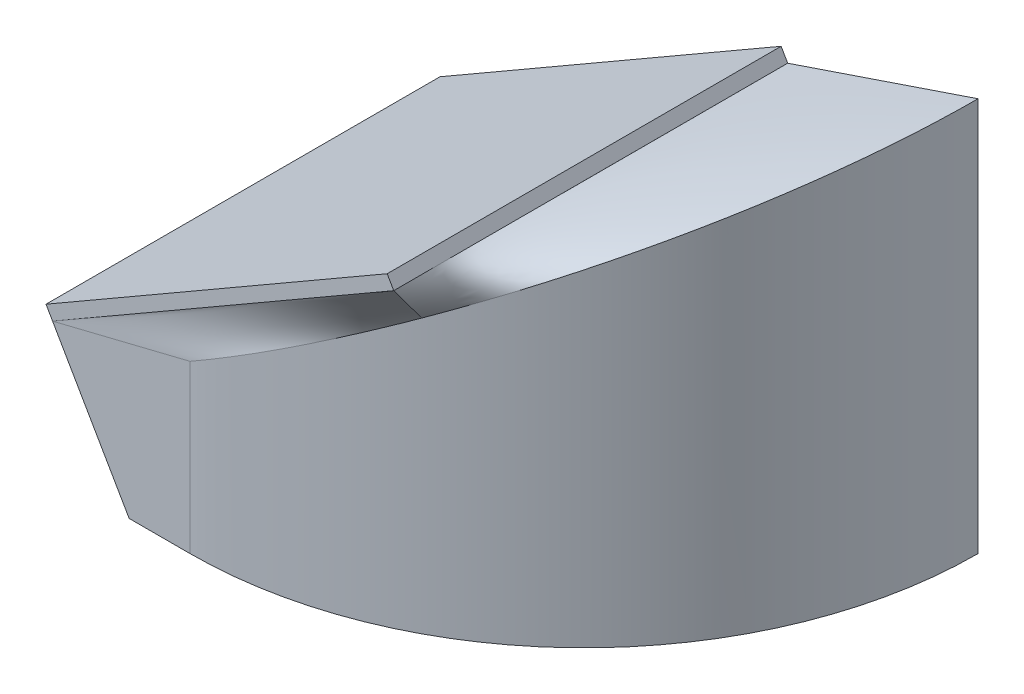
ISO-10303-21;
HEADER;
FILE_DESCRIPTION(('STEP AP214'),'2;1');
FILE_NAME('part.step','',(''),(''),'','','');
FILE_SCHEMA(('AUTOMOTIVE_DESIGN { 1 0 10303 214 1 1 1 1 }'));
ENDSEC;
DATA;
#1=APPLICATION_CONTEXT('core data for automotive mechanical design processes');
#2=APPLICATION_PROTOCOL_DEFINITION('international standard','automotive_design',2000,#1);
#3=PRODUCT_CONTEXT('',#1,'mechanical');
#4=PRODUCT('Part','Part','',(#3));
#5=PRODUCT_RELATED_PRODUCT_CATEGORY('part','',(#4));
#6=PRODUCT_DEFINITION_FORMATION('','',#4);
#7=PRODUCT_DEFINITION_CONTEXT('part definition',#1,'design');
#8=PRODUCT_DEFINITION('design','',#6,#7);
#9=PRODUCT_DEFINITION_SHAPE('','',#8);
#10=(LENGTH_UNIT() NAMED_UNIT(*) SI_UNIT(.MILLI.,.METRE.));
#11=(NAMED_UNIT(*) PLANE_ANGLE_UNIT() SI_UNIT($,.RADIAN.));
#12=(NAMED_UNIT(*) SI_UNIT($,.STERADIAN.) SOLID_ANGLE_UNIT());
#13=UNCERTAINTY_MEASURE_WITH_UNIT(LENGTH_MEASURE(1.E-05),#10,'distance_accuracy_value','');
#14=(GEOMETRIC_REPRESENTATION_CONTEXT(3) GLOBAL_UNCERTAINTY_ASSIGNED_CONTEXT((#13)) GLOBAL_UNIT_ASSIGNED_CONTEXT((#10,
#11,#12)) REPRESENTATION_CONTEXT('',''));
#15=CARTESIAN_POINT('',(0.,0.,0.));
#16=DIRECTION('',(0.,0.,1.));
#17=DIRECTION('',(1.,0.,0.));
#18=AXIS2_PLACEMENT_3D('',#15,#16,#17);
#19=CARTESIAN_POINT('',(15.0096189432334,25.9641016151379,0.));
#20=DIRECTION('',(-0.866025403784442,-0.499999999999995,0.));
#21=DIRECTION('',(0.499999999999995,-0.866025403784442,0.));
#22=AXIS2_PLACEMENT_3D('',#19,#20,#21);
#23=PLANE('',#22);
#24=DIRECTION('',(0.,0.,1.));
#25=VECTOR('',#24,1.);
#26=CARTESIAN_POINT('',(15.5096189432334,25.0980762113534,0.));
#27=LINE('',#26,#25);
#28=CARTESIAN_POINT('',(15.5096189432334,25.0980762113534,30.));
#29=VERTEX_POINT('',#28);
#30=CARTESIAN_POINT('',(15.5096189432334,25.0980762113534,26.7532461457022));
#31=VERTEX_POINT('',#30);
#32=EDGE_CURVE('E101',#29,#31,#27,.F.);
#33=ORIENTED_EDGE('',*,*,#32,.T.);
#34=CARTESIAN_POINT('',(15.5096189432334,25.0980762113534,0.));
#35=CARTESIAN_POINT('',(15.5096189432334,25.0980762113534,1.25000000000001));
#36=CARTESIAN_POINT('',(15.5096189432334,25.0980762113534,2.50000000000002));
#37=CARTESIAN_POINT('',(15.5096189432334,25.0980762113534,5.00000000000003));
#38=CARTESIAN_POINT('',(15.5096189432334,25.0980762113534,6.25000000000003));
#39=CARTESIAN_POINT('',(15.5096189432334,25.0980762113534,8.75000000000004));
#40=CARTESIAN_POINT('',(15.5096189432334,25.0980762113534,10.));
#41=CARTESIAN_POINT('',(15.5096189432334,25.0980762113534,12.5));
#42=CARTESIAN_POINT('',(15.5096189432334,25.0980762113534,13.75));
#43=CARTESIAN_POINT('',(15.5096189432334,25.0980762113534,16.25));
#44=CARTESIAN_POINT('',(15.5096189432334,25.0980762113534,17.5));
#45=CARTESIAN_POINT('',(15.5096189432334,25.0980762113534,20.));
#46=CARTESIAN_POINT('',(15.5096189432334,25.0980762113534,21.25));
#47=CARTESIAN_POINT('',(15.5096189432334,25.0980762113534,23.75));
#48=CARTESIAN_POINT('',(15.5096189432334,25.0980762113534,25.));
#49=CARTESIAN_POINT('',(15.5096189432334,25.0980762113534,27.5));
#50=CARTESIAN_POINT('',(15.5096189432334,25.0980762113534,28.75));
#51=CARTESIAN_POINT('',(15.5096189432334,25.0980762113534,30.));
#52=B_SPLINE_CURVE_WITH_KNOTS('',3,(#34,#35,#36,#37,#38,#39,#40,#41,#42,#43,#44,#45,#46,#47,#48,
#49,#50,#51),.UNSPECIFIED.,.F.,.F.,(4,2,2,2,2,2,2,2,4),(0.,0.125,0.25,0.375,0.5,0.625,0.75,
0.875,1.),.UNSPECIFIED.);
#53=CARTESIAN_POINT('',(15.5096189432334,25.0980762113534,0.));
#54=VERTEX_POINT('',#53);
#55=EDGE_CURVE('E160',#31,#54,#52,.F.);
#56=ORIENTED_EDGE('',*,*,#55,.T.);
#57=DIRECTION('',(0.499999999999995,-0.866025403784442,0.));
#58=VECTOR('',#57,1.);
#59=CARTESIAN_POINT('',(15.0096189432334,25.9641016151379,0.));
#60=LINE('',#59,#58);
#61=CARTESIAN_POINT('',(15.0096189432334,25.9641016151379,0.));
#62=VERTEX_POINT('',#61);
#63=EDGE_CURVE('E12',#62,#54,#60,.T.);
#64=ORIENTED_EDGE('',*,*,#63,.F.);
#65=DIRECTION('',(0.,0.,-1.));
#66=VECTOR('',#65,1.);
#67=CARTESIAN_POINT('',(15.0096189432334,25.9641016151379,0.));
#68=LINE('',#67,#66);
#69=CARTESIAN_POINT('',(15.0096189432334,25.9641016151379,30.));
#70=VERTEX_POINT('',#69);
#71=EDGE_CURVE('E128',#70,#62,#68,.T.);
#72=ORIENTED_EDGE('',*,*,#71,.F.);
#73=DIRECTION('',(0.499999999999995,-0.866025403784442,0.));
#74=VECTOR('',#73,1.);
#75=CARTESIAN_POINT('',(15.0096189432334,25.9641016151379,30.));
#76=LINE('',#75,#74);
#77=EDGE_CURVE('E148',#70,#29,#76,.T.);
#78=ORIENTED_EDGE('',*,*,#77,.T.);
#79=EDGE_LOOP('',(#33,#56,#64,#72,#78));
#80=FACE_BOUND('',#79,.T.);
#81=ADVANCED_FACE('F58',(#80),#23,.F.);
#82=CARTESIAN_POINT('',(-10.9711431702998,10.964101615138,0.));
#83=DIRECTION('',(0.,0.,1.));
#84=DIRECTION('',(1.,0.,0.));
#85=AXIS2_PLACEMENT_3D('',#82,#83,#84);
#86=PLANE('',#85);
#87=ORIENTED_EDGE('',*,*,#63,.T.);
#88=DIRECTION('',(-0.947265843177541,-0.320448782723764,0.));
#89=VECTOR('',#88,1.);
#90=CARTESIAN_POINT('',(22.7548094716167,27.5490381056767,0.));
#91=LINE('',#90,#89);
#92=CARTESIAN_POINT('',(30.,30.,0.));
#93=VERTEX_POINT('',#92);
#94=EDGE_CURVE('E227',#93,#54,#91,.T.);
#95=ORIENTED_EDGE('',*,*,#94,.F.);
#96=DIRECTION('',(0.,1.,0.));
#97=VECTOR('',#96,1.);
#98=CARTESIAN_POINT('',(30.,0.,0.));
#99=LINE('',#98,#97);
#100=CARTESIAN_POINT('',(30.,0.,0.));
#101=VERTEX_POINT('',#100);
#102=EDGE_CURVE('E243',#101,#93,#99,.T.);
#103=ORIENTED_EDGE('',*,*,#102,.F.);
#104=DIRECTION('',(1.,0.,0.));
#105=VECTOR('',#104,1.);
#106=CARTESIAN_POINT('',(0.,0.,0.));
#107=LINE('',#106,#105);
#108=CARTESIAN_POINT('',(-4.6410161513775,0.,0.));
#109=VERTEX_POINT('',#108);
#110=EDGE_CURVE('E138',#109,#101,#107,.T.);
#111=ORIENTED_EDGE('',*,*,#110,.F.);
#112=DIRECTION('',(0.499999999999995,-0.866025403784442,0.));
#113=VECTOR('',#112,1.);
#114=CARTESIAN_POINT('',(-10.9711431702998,10.964101615138,0.));
#115=LINE('',#114,#113);
#116=CARTESIAN_POINT('',(-10.9711431702998,10.964101615138,0.));
#117=VERTEX_POINT('',#116);
#118=EDGE_CURVE('E67',#117,#109,#115,.T.);
#119=ORIENTED_EDGE('',*,*,#118,.F.);
#120=DIRECTION('',(-0.866025403784442,-0.499999999999995,0.));
#121=VECTOR('',#120,1.);
#122=CARTESIAN_POINT('',(-10.9711431702998,10.964101615138,0.));
#123=LINE('',#122,#121);
#124=EDGE_CURVE('E121',#62,#117,#123,.T.);
#125=ORIENTED_EDGE('',*,*,#124,.F.);
#126=EDGE_LOOP('',(#87,#95,#103,#111,#119,#125));
#127=FACE_BOUND('',#126,.T.);
#128=ADVANCED_FACE('F134',(#127),#86,.F.);
#129=CARTESIAN_POINT('',(-10.9711431702998,10.964101615138,0.));
#130=DIRECTION('',(0.866025403784442,0.499999999999995,0.));
#131=DIRECTION('',(-0.499999999999995,0.866025403784442,0.));
#132=AXIS2_PLACEMENT_3D('',#129,#130,#131);
#133=PLANE('',#132);
#134=ORIENTED_EDGE('',*,*,#118,.T.);
#135=DIRECTION('',(0.,0.,-1.));
#136=VECTOR('',#135,1.);
#137=CARTESIAN_POINT('',(-4.6410161513775,0.,0.));
#138=LINE('',#137,#136);
#139=CARTESIAN_POINT('',(-4.64101615137751,0.,30.));
#140=VERTEX_POINT('',#139);
#141=EDGE_CURVE('E263',#140,#109,#138,.T.);
#142=ORIENTED_EDGE('',*,*,#141,.F.);
#143=DIRECTION('',(-0.499999999999996,0.866025403784441,0.));
#144=VECTOR('',#143,1.);
#145=CARTESIAN_POINT('',(-8.97114317029982,7.50000000000027,30.));
#146=LINE('',#145,#144);
#147=CARTESIAN_POINT('',(-10.4711431702998,10.0980762113536,30.));
#148=VERTEX_POINT('',#147);
#149=EDGE_CURVE('E233',#140,#148,#146,.T.);
#150=ORIENTED_EDGE('',*,*,#149,.T.);
#151=DIRECTION('',(0.499999999999995,-0.866025403784442,0.));
#152=VECTOR('',#151,1.);
#153=CARTESIAN_POINT('',(-10.9711431702998,10.964101615138,30.));
#154=LINE('',#153,#152);
#155=CARTESIAN_POINT('',(-10.9711431702998,10.964101615138,30.));
#156=VERTEX_POINT('',#155);
#157=EDGE_CURVE('E142',#156,#148,#154,.T.);
#158=ORIENTED_EDGE('',*,*,#157,.F.);
#159=DIRECTION('',(0.,0.,1.));
#160=VECTOR('',#159,1.);
#161=CARTESIAN_POINT('',(-10.9711431702998,10.964101615138,0.));
#162=LINE('',#161,#160);
#163=EDGE_CURVE('E125',#117,#156,#162,.T.);
#164=ORIENTED_EDGE('',*,*,#163,.F.);
#165=EDGE_LOOP('',(#134,#142,#150,#158,#164));
#166=FACE_BOUND('',#165,.T.);
#167=ADVANCED_FACE('F144',(#166),#133,.F.);
#168=CARTESIAN_POINT('',(-10.9711431702998,10.964101615138,30.));
#169=DIRECTION('',(0.,0.,-1.));
#170=DIRECTION('',(-1.,0.,0.));
#171=AXIS2_PLACEMENT_3D('',#168,#169,#170);
#172=PLANE('',#171);
#173=DIRECTION('',(0.866025403784442,0.499999999999995,0.));
#174=VECTOR('',#173,1.);
#175=CARTESIAN_POINT('',(-10.4711431702998,10.0980762113536,30.));
#176=LINE('',#175,#174);
#177=EDGE_CURVE('E172',#148,#29,#176,.T.);
#178=ORIENTED_EDGE('',*,*,#177,.T.);
#179=ORIENTED_EDGE('',*,*,#77,.F.);
#180=DIRECTION('',(0.866025403784442,0.499999999999995,0.));
#181=VECTOR('',#180,1.);
#182=CARTESIAN_POINT('',(-10.9711431702998,10.964101615138,30.));
#183=LINE('',#182,#181);
#184=EDGE_CURVE('E85',#156,#70,#183,.T.);
#185=ORIENTED_EDGE('',*,*,#184,.F.);
#186=ORIENTED_EDGE('',*,*,#157,.T.);
#187=EDGE_LOOP('',(#178,#179,#185,#186));
#188=FACE_BOUND('',#187,.T.);
#189=ADVANCED_FACE('F230',(#188),#172,.F.);
#190=CARTESIAN_POINT('',(-7.49038105676662,12.9737205583714,0.));
#191=DIRECTION('',(-0.499999999999995,0.866025403784442,0.));
#192=DIRECTION('',(-0.866025403784442,-0.499999999999995,0.));
#193=AXIS2_PLACEMENT_3D('',#190,#191,#192);
#194=PLANE('',#193);
#195=ORIENTED_EDGE('',*,*,#71,.T.);
#196=ORIENTED_EDGE('',*,*,#124,.T.);
#197=ORIENTED_EDGE('',*,*,#163,.T.);
#198=ORIENTED_EDGE('',*,*,#184,.T.);
#199=EDGE_LOOP('',(#195,#196,#197,#198));
#200=FACE_BOUND('',#199,.T.);
#201=ADVANCED_FACE('F123',(#200),#194,.T.);
#202=CARTESIAN_POINT('',(14.114703160078,20.8286195933141,26.4721581043723));
#203=CARTESIAN_POINT('',(15.5096189432334,25.0980762113534,30.));
#204=CARTESIAN_POINT('',(15.2497927587654,21.4839638786706,25.8669391160905));
#205=CARTESIAN_POINT('',(15.5096189432334,25.0980762113534,28.75));
#206=CARTESIAN_POINT('',(16.3662543490578,22.1285532783657,25.1775427505839));
#207=CARTESIAN_POINT('',(15.5096189432334,25.0980762113534,27.5));
#208=CARTESIAN_POINT('',(18.526550531577,23.3758008608725,23.6332364642776));
#209=CARTESIAN_POINT('',(15.5096189432334,25.0980762113534,25.));
#210=CARTESIAN_POINT('',(19.5702759134882,23.978395991079,22.778304961004));
#211=CARTESIAN_POINT('',(15.5096189432334,25.0980762113534,23.75));
#212=CARTESIAN_POINT('',(21.5496061952353,25.1211628620608,20.9155767086838));
#213=CARTESIAN_POINT('',(15.5096189432334,25.0980762113534,21.25));
#214=CARTESIAN_POINT('',(22.4850943508354,25.6612672005202,19.9078044866267));
#215=CARTESIAN_POINT('',(15.5096189432334,25.0980762113534,20.));
#216=CARTESIAN_POINT('',(24.2159675344353,26.6605872990047,17.7619555177604));
#217=CARTESIAN_POINT('',(15.5096189432334,25.0980762113534,17.5));
#218=CARTESIAN_POINT('',(25.0112510488693,27.1197444501453,16.6239507489123));
#219=CARTESIAN_POINT('',(15.5096189432334,25.0980762113534,16.25));
#220=CARTESIAN_POINT('',(26.4366078920495,27.9426746072466,14.2486553995054));
#221=CARTESIAN_POINT('',(15.5096189432334,25.0980762113534,13.75));
#222=CARTESIAN_POINT('',(27.066616273054,28.3064101156113,13.0114730515407));
#223=CARTESIAN_POINT('',(15.5096189432334,25.0980762113534,12.5));
#224=CARTESIAN_POINT('',(28.1457660056434,28.9294575042177,10.4745407249812));
#225=CARTESIAN_POINT('',(15.5096189432334,25.0980762113534,10.));
#226=CARTESIAN_POINT('',(28.5948916046243,29.1887602896892,9.17491418741055));
#227=CARTESIAN_POINT('',(15.5096189432334,25.0980762113534,8.75000000000004));
#228=CARTESIAN_POINT('',(29.3073175185672,29.6000795828819,6.55194750379149));
#229=CARTESIAN_POINT('',(15.5096189432334,25.0980762113534,6.25000000000003));
#230=CARTESIAN_POINT('',(29.5706511177922,29.7521153072811,5.22872191317791));
#231=CARTESIAN_POINT('',(15.5096189432334,25.0980762113534,5.00000000000003));
#232=CARTESIAN_POINT('',(29.9169571450779,29.9520551853564,2.59588434933201));
#233=CARTESIAN_POINT('',(15.5096189432334,25.0980762113534,2.50000000000002));
#234=CARTESIAN_POINT('',(30.,30.,1.2863585895174));
#235=CARTESIAN_POINT('',(15.5096189432334,25.0980762113534,1.25000000000001));
#236=CARTESIAN_POINT('',(30.,30.,0.));
#237=CARTESIAN_POINT('',(15.5096189432334,25.0980762113534,0.));
#238=B_SPLINE_SURFACE_WITH_KNOTS('',3,1,((#202,#203),(#204,#205),(#206,#207),(#208,#209),(#210,
#211),(#212,#213),(#214,#215),(#216,#217),(#218,#219),(#220,#221),(#222,#223),(#224,#225),(#226,
#227),(#228,#229),(#230,#231),(#232,#233),(#234,#235),(#236,#237)),.UNSPECIFIED.,.F.,.F.,.F.,(4,
2,2,2,2,2,2,2,4),(2,2),(0.,0.125,0.25,0.375,0.5,0.625,0.75,0.875,1.),(0.,1.),.UNSPECIFIED.);
#239=CARTESIAN_POINT('',(0.,12.6794919243115,0.));
#240=DIRECTION('',(0.499999999999995,-0.866025403784442,0.));
#241=DIRECTION('',(-0.866025403784442,-0.499999999999995,0.));
#242=AXIS2_PLACEMENT_3D('',#239,#240,#241);
#243=ELLIPSE('',#242,34.6410161513774,30.);
#244=CARTESIAN_POINT('',(17.446403178755,22.7521774959562,24.4053910581902));
#245=VERTEX_POINT('',#244);
#246=EDGE_CURVE('E232',#93,#245,#243,.T.);
#247=DIRECTION('',(-0.244234991396221,-0.747536670647317,-0.617687781176876));
#248=VECTOR('',#247,1.);
#249=CARTESIAN_POINT('',(14.8121610516557,22.9633479023338,28.2360790521861));
#250=LINE('',#249,#248);
#251=CARTESIAN_POINT('',(14.114703160078,20.8286195933141,26.4721581043723));
#252=VERTEX_POINT('',#251);
#253=EDGE_CURVE('E186',#29,#252,#250,.T.);
#254=CARTESIAN_POINT('',(14.114703160078,20.8286195933141,26.4721581043723));
#255=CARTESIAN_POINT('',(15.2497927587654,21.4839638786706,25.8669391160905));
#256=CARTESIAN_POINT('',(16.3662543490578,22.1285532783657,25.1775427505839));
#257=CARTESIAN_POINT('',(18.526550531577,23.3758008608725,23.6332364642776));
#258=CARTESIAN_POINT('',(19.5702759134882,23.978395991079,22.778304961004));
#259=CARTESIAN_POINT('',(21.5496061952353,25.1211628620608,20.9155767086838));
#260=CARTESIAN_POINT('',(22.4850943508354,25.6612672005202,19.9078044866267));
#261=CARTESIAN_POINT('',(24.2159675344353,26.6605872990047,17.7619555177604));
#262=CARTESIAN_POINT('',(25.0112510488693,27.1197444501453,16.6239507489123));
#263=CARTESIAN_POINT('',(26.4366078920495,27.9426746072466,14.2486553995054));
#264=CARTESIAN_POINT('',(27.066616273054,28.3064101156113,13.0114730515407));
#265=CARTESIAN_POINT('',(28.1457660056434,28.9294575042177,10.4745407249812));
#266=CARTESIAN_POINT('',(28.5948916046243,29.1887602896892,9.17491418741055));
#267=CARTESIAN_POINT('',(29.3073175185672,29.6000795828819,6.55194750379149));
#268=CARTESIAN_POINT('',(29.5706511177922,29.7521153072811,5.22872191317791));
#269=CARTESIAN_POINT('',(29.9169571450779,29.9520551853564,2.59588434933201));
#270=CARTESIAN_POINT('',(30.,30.,1.2863585895174));
#271=CARTESIAN_POINT('',(30.,30.,0.));
#272=B_SPLINE_CURVE_WITH_KNOTS('',3,(#254,#255,#256,#257,#258,#259,#260,#261,#262,#263,#264,
#265,#266,#267,#268,#269,#270,#271),.UNSPECIFIED.,.F.,.F.,(4,2,2,2,2,2,2,2,4),(0.,0.125,0.25,
0.375,0.5,0.625,0.75,0.875,1.),.UNSPECIFIED.);
#273=EDGE_CURVE('E75',#245,#252,#272,.F.);
#274=ORIENTED_EDGE('',*,*,#246,.F.);
#275=ORIENTED_EDGE('',*,*,#94,.T.);
#276=ORIENTED_EDGE('',*,*,#55,.F.);
#277=ORIENTED_EDGE('',*,*,#32,.F.);
#278=ORIENTED_EDGE('',*,*,#253,.T.);
#279=ORIENTED_EDGE('',*,*,#273,.F.);
#280=EDGE_LOOP('',(#274,#275,#276,#277,#278,#279));
#281=FACE_BOUND('',#280,.T.);
#282=ADVANCED_FACE('F189',(#281),#238,.T.);
#283=CARTESIAN_POINT('',(0.,12.6794919243115,30.));
#284=CARTESIAN_POINT('',(-10.4711431702998,10.0980762113536,30.));
#285=CARTESIAN_POINT('',(2.42481679570084,14.0794605540449,30.));
#286=CARTESIAN_POINT('',(-6.14101615137761,12.5980762113536,30.));
#287=CARTESIAN_POINT('',(4.88636482972754,15.5006359741133,29.7015598491834));
#288=CARTESIAN_POINT('',(-1.8108891324554,15.0980762113535,30.));
#289=CARTESIAN_POINT('',(9.66253594447748,18.2581596529099,28.5077992459169));
#290=CARTESIAN_POINT('',(6.84936490538902,20.0980762113535,30.));
#291=CARTESIAN_POINT('',(11.9750320404137,19.5932798963986,27.6130104140019));
#292=CARTESIAN_POINT('',(11.1794919243112,22.5980762113535,30.));
#293=CARTESIAN_POINT('',(14.114703160078,20.8286195933141,26.4721581043723));
#294=CARTESIAN_POINT('',(15.5096189432334,25.0980762113534,30.));
#295=B_SPLINE_SURFACE_WITH_KNOTS('',3,1,((#283,#284),(#285,#286),(#287,#288),(#289,#290),(#291,
#292),(#293,#294)),.UNSPECIFIED.,.F.,.F.,.F.,(4,2,4),(2,2),(0.,0.5,1.),(0.,1.),.UNSPECIFIED.);
#296=CARTESIAN_POINT('',(0.,12.6794919243115,30.));
#297=VERTEX_POINT('',#296);
#298=EDGE_CURVE('E111',#252,#297,#243,.T.);
#299=DIRECTION('',(-0.970930812614628,-0.239360308145476,0.));
#300=VECTOR('',#299,1.);
#301=CARTESIAN_POINT('',(-5.23557158514991,11.3887840678325,30.));
#302=LINE('',#301,#300);
#303=EDGE_CURVE('E228',#297,#148,#302,.T.);
#304=ORIENTED_EDGE('',*,*,#298,.F.);
#305=ORIENTED_EDGE('',*,*,#253,.F.);
#306=ORIENTED_EDGE('',*,*,#177,.F.);
#307=ORIENTED_EDGE('',*,*,#303,.F.);
#308=EDGE_LOOP('',(#304,#305,#306,#307));
#309=FACE_BOUND('',#308,.T.);
#310=ADVANCED_FACE('F201',(#309),#295,.T.);
#311=CARTESIAN_POINT('',(-8.97114317029982,7.50000000000027,30.));
#312=DIRECTION('',(0.,0.,1.));
#313=DIRECTION('',(0.866025403784442,0.499999999999995,0.));
#314=AXIS2_PLACEMENT_3D('',#311,#312,#313);
#315=PLANE('',#314);
#316=ORIENTED_EDGE('',*,*,#149,.F.);
#317=DIRECTION('',(1.,0.,0.));
#318=VECTOR('',#317,1.);
#319=CARTESIAN_POINT('',(-20.,0.,30.));
#320=LINE('',#319,#318);
#321=CARTESIAN_POINT('',(0.,0.,30.));
#322=VERTEX_POINT('',#321);
#323=EDGE_CURVE('E270',#140,#322,#320,.T.);
#324=ORIENTED_EDGE('',*,*,#323,.T.);
#325=DIRECTION('',(0.,-1.,0.));
#326=VECTOR('',#325,1.);
#327=CARTESIAN_POINT('',(0.,30.,30.));
#328=LINE('',#327,#326);
#329=EDGE_CURVE('E178',#297,#322,#328,.T.);
#330=ORIENTED_EDGE('',*,*,#329,.F.);
#331=ORIENTED_EDGE('',*,*,#303,.T.);
#332=EDGE_LOOP('',(#316,#324,#330,#331));
#333=FACE_BOUND('',#332,.T.);
#334=ADVANCED_FACE('F283',(#333),#315,.T.);
#335=CARTESIAN_POINT('',(0.,30.,0.));
#336=DIRECTION('',(0.,-1.,0.));
#337=DIRECTION('',(0.,0.,-1.));
#338=AXIS2_PLACEMENT_3D('',#335,#336,#337);
#339=CYLINDRICAL_SURFACE('',#338,30.);
#340=ORIENTED_EDGE('',*,*,#102,.T.);
#341=ORIENTED_EDGE('',*,*,#246,.T.);
#342=ORIENTED_EDGE('',*,*,#273,.T.);
#343=ORIENTED_EDGE('',*,*,#298,.T.);
#344=ORIENTED_EDGE('',*,*,#329,.T.);
#345=CARTESIAN_POINT('',(0.,0.,0.));
#346=DIRECTION('',(0.,1.,0.));
#347=DIRECTION('',(0.,0.,1.));
#348=AXIS2_PLACEMENT_3D('',#345,#346,#347);
#349=CIRCLE('',#348,30.);
#350=EDGE_CURVE('E264',#322,#101,#349,.T.);
#351=ORIENTED_EDGE('',*,*,#350,.T.);
#352=EDGE_LOOP('',(#340,#341,#342,#343,#344,#351));
#353=FACE_BOUND('',#352,.T.);
#354=ADVANCED_FACE('F202',(#353),#339,.T.);
#355=CARTESIAN_POINT('',(0.,0.,0.));
#356=DIRECTION('',(0.,1.,0.));
#357=DIRECTION('',(0.,0.,1.));
#358=AXIS2_PLACEMENT_3D('',#355,#356,#357);
#359=PLANE('',#358);
#360=ORIENTED_EDGE('',*,*,#323,.F.);
#361=ORIENTED_EDGE('',*,*,#141,.T.);
#362=ORIENTED_EDGE('',*,*,#110,.T.);
#363=ORIENTED_EDGE('',*,*,#350,.F.);
#364=EDGE_LOOP('',(#360,#361,#362,#363));
#365=FACE_BOUND('',#364,.T.);
#366=ADVANCED_FACE('F277',(#365),#359,.F.);
#367=CLOSED_SHELL('',(#81,#128,#167,#189,#201,#282,#310,#334,#354,#366));
#368=MANIFOLD_SOLID_BREP('B2',#367);
#369=ADVANCED_BREP_SHAPE_REPRESENTATION('',(#18,#368),#14);
#370=SHAPE_DEFINITION_REPRESENTATION(#9,#369);
ENDSEC;
END-ISO-10303-21;
